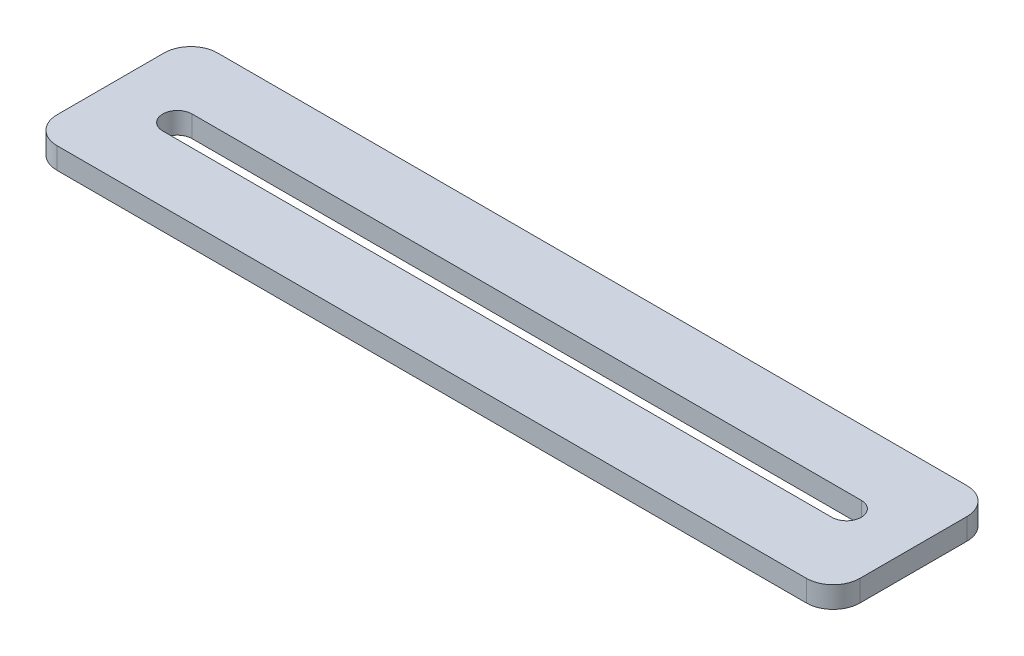
ISO-10303-21;
HEADER;
FILE_DESCRIPTION(('STEP AP214'),'2;1');
FILE_NAME('part.step','',(''),(''),'','','');
FILE_SCHEMA(('AUTOMOTIVE_DESIGN { 1 0 10303 214 1 1 1 1 }'));
ENDSEC;
DATA;
#1=APPLICATION_CONTEXT('core data for automotive mechanical design processes');
#2=APPLICATION_PROTOCOL_DEFINITION('international standard','automotive_design',2000,#1);
#3=PRODUCT_CONTEXT('',#1,'mechanical');
#4=PRODUCT('Part','Part','',(#3));
#5=PRODUCT_RELATED_PRODUCT_CATEGORY('part','',(#4));
#6=PRODUCT_DEFINITION_FORMATION('','',#4);
#7=PRODUCT_DEFINITION_CONTEXT('part definition',#1,'design');
#8=PRODUCT_DEFINITION('design','',#6,#7);
#9=PRODUCT_DEFINITION_SHAPE('','',#8);
#10=(LENGTH_UNIT() NAMED_UNIT(*) SI_UNIT(.MILLI.,.METRE.));
#11=(NAMED_UNIT(*) PLANE_ANGLE_UNIT() SI_UNIT($,.RADIAN.));
#12=(NAMED_UNIT(*) SI_UNIT($,.STERADIAN.) SOLID_ANGLE_UNIT());
#13=UNCERTAINTY_MEASURE_WITH_UNIT(LENGTH_MEASURE(1.E-05),#10,'distance_accuracy_value','');
#14=(GEOMETRIC_REPRESENTATION_CONTEXT(3) GLOBAL_UNCERTAINTY_ASSIGNED_CONTEXT((#13)) GLOBAL_UNIT_ASSIGNED_CONTEXT((#10,
#11,#12)) REPRESENTATION_CONTEXT('',''));
#15=CARTESIAN_POINT('',(0.,0.,0.));
#16=DIRECTION('',(0.,0.,1.));
#17=DIRECTION('',(1.,0.,0.));
#18=AXIS2_PLACEMENT_3D('',#15,#16,#17);
#19=CARTESIAN_POINT('',(0.,4.,0.));
#20=DIRECTION('',(0.,-1.,0.));
#21=DIRECTION('',(0.,0.,-1.));
#22=AXIS2_PLACEMENT_3D('',#19,#20,#21);
#23=PLANE('',#22);
#24=DIRECTION('',(1.,0.,0.));
#25=VECTOR('',#24,1.);
#26=CARTESIAN_POINT('',(-75.,4.,15.));
#27=LINE('',#26,#25);
#28=CARTESIAN_POINT('',(-70.,4.,15.));
#29=VERTEX_POINT('',#28);
#30=CARTESIAN_POINT('',(70.,4.,15.));
#31=VERTEX_POINT('',#30);
#32=EDGE_CURVE('E173',#29,#31,#27,.T.);
#33=ORIENTED_EDGE('',*,*,#32,.T.);
#34=CARTESIAN_POINT('',(70.,4.,10.));
#35=DIRECTION('',(0.,-1.,0.));
#36=DIRECTION('',(0.,0.,-1.));
#37=AXIS2_PLACEMENT_3D('',#34,#35,#36);
#38=CIRCLE('',#37,5.);
#39=CARTESIAN_POINT('',(75.,4.,10.));
#40=VERTEX_POINT('',#39);
#41=EDGE_CURVE('E208',#31,#40,#38,.F.);
#42=ORIENTED_EDGE('',*,*,#41,.T.);
#43=DIRECTION('',(0.,0.,-1.));
#44=VECTOR('',#43,1.);
#45=CARTESIAN_POINT('',(75.,4.,15.));
#46=LINE('',#45,#44);
#47=CARTESIAN_POINT('',(75.,4.,-10.));
#48=VERTEX_POINT('',#47);
#49=EDGE_CURVE('E165',#40,#48,#46,.T.);
#50=ORIENTED_EDGE('',*,*,#49,.T.);
#51=CARTESIAN_POINT('',(70.,4.,-10.));
#52=DIRECTION('',(0.,-1.,0.));
#53=DIRECTION('',(0.,0.,-1.));
#54=AXIS2_PLACEMENT_3D('',#51,#52,#53);
#55=CIRCLE('',#54,5.);
#56=CARTESIAN_POINT('',(70.,4.,-15.));
#57=VERTEX_POINT('',#56);
#58=EDGE_CURVE('E206',#48,#57,#55,.F.);
#59=ORIENTED_EDGE('',*,*,#58,.T.);
#60=DIRECTION('',(-1.,0.,0.));
#61=VECTOR('',#60,1.);
#62=CARTESIAN_POINT('',(-75.,4.,-15.));
#63=LINE('',#62,#61);
#64=CARTESIAN_POINT('',(-70.,4.,-15.));
#65=VERTEX_POINT('',#64);
#66=EDGE_CURVE('E168',#57,#65,#63,.T.);
#67=ORIENTED_EDGE('',*,*,#66,.T.);
#68=CARTESIAN_POINT('',(-70.,4.,-10.));
#69=DIRECTION('',(0.,-1.,0.));
#70=DIRECTION('',(0.,0.,-1.));
#71=AXIS2_PLACEMENT_3D('',#68,#69,#70);
#72=CIRCLE('',#71,5.);
#73=CARTESIAN_POINT('',(-75.,4.,-10.));
#74=VERTEX_POINT('',#73);
#75=EDGE_CURVE('E54',#65,#74,#72,.F.);
#76=ORIENTED_EDGE('',*,*,#75,.T.);
#77=DIRECTION('',(0.,0.,1.));
#78=VECTOR('',#77,1.);
#79=CARTESIAN_POINT('',(-75.,4.,15.));
#80=LINE('',#79,#78);
#81=CARTESIAN_POINT('',(-75.,4.,10.));
#82=VERTEX_POINT('',#81);
#83=EDGE_CURVE('E171',#74,#82,#80,.T.);
#84=ORIENTED_EDGE('',*,*,#83,.T.);
#85=CARTESIAN_POINT('',(-70.,4.,10.));
#86=DIRECTION('',(0.,-1.,0.));
#87=DIRECTION('',(0.,0.,-1.));
#88=AXIS2_PLACEMENT_3D('',#85,#86,#87);
#89=CIRCLE('',#88,5.);
#90=EDGE_CURVE('E203',#82,#29,#89,.F.);
#91=ORIENTED_EDGE('',*,*,#90,.T.);
#92=EDGE_LOOP('',(#33,#42,#50,#59,#67,#76,#84,#91));
#93=FACE_BOUND('',#92,.T.);
#94=CARTESIAN_POINT('',(-62.5,4.,0.));
#95=DIRECTION('',(0.,1.,0.));
#96=DIRECTION('',(0.,0.,1.));
#97=AXIS2_PLACEMENT_3D('',#94,#95,#96);
#98=CIRCLE('',#97,2.75);
#99=CARTESIAN_POINT('',(-62.5,4.,-2.75));
#100=VERTEX_POINT('',#99);
#101=CARTESIAN_POINT('',(-62.5,4.,2.75));
#102=VERTEX_POINT('',#101);
#103=EDGE_CURVE('E124',#100,#102,#98,.T.);
#104=ORIENTED_EDGE('',*,*,#103,.F.);
#105=DIRECTION('',(-1.,0.,0.));
#106=VECTOR('',#105,1.);
#107=CARTESIAN_POINT('',(-62.5,4.,-2.75));
#108=LINE('',#107,#106);
#109=CARTESIAN_POINT('',(62.5,4.,-2.75000000000002));
#110=VERTEX_POINT('',#109);
#111=EDGE_CURVE('E149',#110,#100,#108,.T.);
#112=ORIENTED_EDGE('',*,*,#111,.F.);
#113=CARTESIAN_POINT('',(62.5,4.,0.));
#114=DIRECTION('',(0.,1.,0.));
#115=DIRECTION('',(0.,0.,1.));
#116=AXIS2_PLACEMENT_3D('',#113,#114,#115);
#117=CIRCLE('',#116,2.75);
#118=CARTESIAN_POINT('',(62.5,4.,2.74999999999998));
#119=VERTEX_POINT('',#118);
#120=EDGE_CURVE('E147',#119,#110,#117,.T.);
#121=ORIENTED_EDGE('',*,*,#120,.F.);
#122=DIRECTION('',(1.,0.,0.));
#123=VECTOR('',#122,1.);
#124=CARTESIAN_POINT('',(-62.5,4.,2.75));
#125=LINE('',#124,#123);
#126=EDGE_CURVE('E134',#102,#119,#125,.T.);
#127=ORIENTED_EDGE('',*,*,#126,.F.);
#128=EDGE_LOOP('',(#104,#112,#121,#127));
#129=FACE_BOUND('',#128,.T.);
#130=ADVANCED_FACE('F33',(#93,#129),#23,.F.);
#131=CARTESIAN_POINT('',(0.,0.,0.));
#132=DIRECTION('',(0.,-1.,0.));
#133=DIRECTION('',(0.,0.,-1.));
#134=AXIS2_PLACEMENT_3D('',#131,#132,#133);
#135=PLANE('',#134);
#136=DIRECTION('',(0.,0.,-1.));
#137=VECTOR('',#136,1.);
#138=CARTESIAN_POINT('',(75.,0.,15.));
#139=LINE('',#138,#137);
#140=CARTESIAN_POINT('',(75.,0.,10.));
#141=VERTEX_POINT('',#140);
#142=CARTESIAN_POINT('',(75.,0.,-10.));
#143=VERTEX_POINT('',#142);
#144=EDGE_CURVE('E142',#141,#143,#139,.T.);
#145=ORIENTED_EDGE('',*,*,#144,.F.);
#146=CARTESIAN_POINT('',(70.,0.,10.));
#147=DIRECTION('',(0.,-1.,0.));
#148=DIRECTION('',(0.,0.,-1.));
#149=AXIS2_PLACEMENT_3D('',#146,#147,#148);
#150=CIRCLE('',#149,5.);
#151=CARTESIAN_POINT('',(70.,0.,15.));
#152=VERTEX_POINT('',#151);
#153=EDGE_CURVE('E196',#141,#152,#150,.T.);
#154=ORIENTED_EDGE('',*,*,#153,.T.);
#155=DIRECTION('',(1.,0.,0.));
#156=VECTOR('',#155,1.);
#157=CARTESIAN_POINT('',(-75.,0.,15.));
#158=LINE('',#157,#156);
#159=CARTESIAN_POINT('',(-70.,0.,15.));
#160=VERTEX_POINT('',#159);
#161=EDGE_CURVE('E169',#160,#152,#158,.T.);
#162=ORIENTED_EDGE('',*,*,#161,.F.);
#163=CARTESIAN_POINT('',(-70.,0.,10.));
#164=DIRECTION('',(0.,-1.,0.));
#165=DIRECTION('',(0.,0.,-1.));
#166=AXIS2_PLACEMENT_3D('',#163,#164,#165);
#167=CIRCLE('',#166,5.);
#168=CARTESIAN_POINT('',(-75.,0.,10.));
#169=VERTEX_POINT('',#168);
#170=EDGE_CURVE('E190',#160,#169,#167,.T.);
#171=ORIENTED_EDGE('',*,*,#170,.T.);
#172=DIRECTION('',(0.,0.,1.));
#173=VECTOR('',#172,1.);
#174=CARTESIAN_POINT('',(-75.,0.,15.));
#175=LINE('',#174,#173);
#176=CARTESIAN_POINT('',(-75.,0.,-10.));
#177=VERTEX_POINT('',#176);
#178=EDGE_CURVE('E182',#177,#169,#175,.T.);
#179=ORIENTED_EDGE('',*,*,#178,.F.);
#180=CARTESIAN_POINT('',(-70.,0.,-10.));
#181=DIRECTION('',(0.,-1.,0.));
#182=DIRECTION('',(0.,0.,-1.));
#183=AXIS2_PLACEMENT_3D('',#180,#181,#182);
#184=CIRCLE('',#183,5.);
#185=CARTESIAN_POINT('',(-70.,0.,-15.));
#186=VERTEX_POINT('',#185);
#187=EDGE_CURVE('E192',#177,#186,#184,.T.);
#188=ORIENTED_EDGE('',*,*,#187,.T.);
#189=DIRECTION('',(-1.,0.,0.));
#190=VECTOR('',#189,1.);
#191=CARTESIAN_POINT('',(-75.,0.,-15.));
#192=LINE('',#191,#190);
#193=CARTESIAN_POINT('',(70.,0.,-15.));
#194=VERTEX_POINT('',#193);
#195=EDGE_CURVE('E179',#194,#186,#192,.T.);
#196=ORIENTED_EDGE('',*,*,#195,.F.);
#197=CARTESIAN_POINT('',(70.,0.,-10.));
#198=DIRECTION('',(0.,-1.,0.));
#199=DIRECTION('',(0.,0.,-1.));
#200=AXIS2_PLACEMENT_3D('',#197,#198,#199);
#201=CIRCLE('',#200,5.);
#202=EDGE_CURVE('E194',#194,#143,#201,.T.);
#203=ORIENTED_EDGE('',*,*,#202,.T.);
#204=EDGE_LOOP('',(#145,#154,#162,#171,#179,#188,#196,#203));
#205=FACE_BOUND('',#204,.T.);
#206=DIRECTION('',(-1.,0.,0.));
#207=VECTOR('',#206,1.);
#208=CARTESIAN_POINT('',(-62.5,0.,-2.75));
#209=LINE('',#208,#207);
#210=CARTESIAN_POINT('',(62.5,0.,-2.75000000000002));
#211=VERTEX_POINT('',#210);
#212=CARTESIAN_POINT('',(-62.5,0.,-2.75));
#213=VERTEX_POINT('',#212);
#214=EDGE_CURVE('E135',#211,#213,#209,.T.);
#215=ORIENTED_EDGE('',*,*,#214,.T.);
#216=CARTESIAN_POINT('',(-62.5,0.,0.));
#217=DIRECTION('',(0.,1.,0.));
#218=DIRECTION('',(0.,0.,1.));
#219=AXIS2_PLACEMENT_3D('',#216,#217,#218);
#220=CIRCLE('',#219,2.75);
#221=CARTESIAN_POINT('',(-62.5,0.,2.75));
#222=VERTEX_POINT('',#221);
#223=EDGE_CURVE('E153',#213,#222,#220,.T.);
#224=ORIENTED_EDGE('',*,*,#223,.T.);
#225=DIRECTION('',(1.,0.,0.));
#226=VECTOR('',#225,1.);
#227=CARTESIAN_POINT('',(-62.5,0.,2.75));
#228=LINE('',#227,#226);
#229=CARTESIAN_POINT('',(62.5,0.,2.74999999999998));
#230=VERTEX_POINT('',#229);
#231=EDGE_CURVE('E141',#222,#230,#228,.T.);
#232=ORIENTED_EDGE('',*,*,#231,.T.);
#233=CARTESIAN_POINT('',(62.5,0.,0.));
#234=DIRECTION('',(0.,1.,0.));
#235=DIRECTION('',(0.,0.,1.));
#236=AXIS2_PLACEMENT_3D('',#233,#234,#235);
#237=CIRCLE('',#236,2.75);
#238=EDGE_CURVE('E156',#230,#211,#237,.T.);
#239=ORIENTED_EDGE('',*,*,#238,.T.);
#240=EDGE_LOOP('',(#215,#224,#232,#239));
#241=FACE_BOUND('',#240,.T.);
#242=ADVANCED_FACE('F224',(#205,#241),#135,.T.);
#243=CARTESIAN_POINT('',(75.,4.,15.));
#244=DIRECTION('',(-1.,0.,0.));
#245=DIRECTION('',(0.,0.,1.));
#246=AXIS2_PLACEMENT_3D('',#243,#244,#245);
#247=PLANE('',#246);
#248=ORIENTED_EDGE('',*,*,#49,.F.);
#249=DIRECTION('',(0.,-1.,0.));
#250=VECTOR('',#249,1.);
#251=CARTESIAN_POINT('',(75.,4.,10.));
#252=LINE('',#251,#250);
#253=EDGE_CURVE('E187',#40,#141,#252,.T.);
#254=ORIENTED_EDGE('',*,*,#253,.T.);
#255=ORIENTED_EDGE('',*,*,#144,.T.);
#256=DIRECTION('',(0.,-1.,0.));
#257=VECTOR('',#256,1.);
#258=CARTESIAN_POINT('',(75.,4.,-10.));
#259=LINE('',#258,#257);
#260=EDGE_CURVE('E176',#143,#48,#259,.F.);
#261=ORIENTED_EDGE('',*,*,#260,.T.);
#262=EDGE_LOOP('',(#248,#254,#255,#261));
#263=FACE_BOUND('',#262,.T.);
#264=ADVANCED_FACE('F245',(#263),#247,.F.);
#265=CARTESIAN_POINT('',(-75.,4.,-15.));
#266=DIRECTION('',(0.,0.,1.));
#267=DIRECTION('',(1.,0.,0.));
#268=AXIS2_PLACEMENT_3D('',#265,#266,#267);
#269=PLANE('',#268);
#270=ORIENTED_EDGE('',*,*,#66,.F.);
#271=DIRECTION('',(0.,-1.,0.));
#272=VECTOR('',#271,1.);
#273=CARTESIAN_POINT('',(70.,4.,-15.));
#274=LINE('',#273,#272);
#275=EDGE_CURVE('E212',#57,#194,#274,.T.);
#276=ORIENTED_EDGE('',*,*,#275,.T.);
#277=ORIENTED_EDGE('',*,*,#195,.T.);
#278=DIRECTION('',(0.,-1.,0.));
#279=VECTOR('',#278,1.);
#280=CARTESIAN_POINT('',(-70.,4.,-15.));
#281=LINE('',#280,#279);
#282=EDGE_CURVE('E210',#186,#65,#281,.F.);
#283=ORIENTED_EDGE('',*,*,#282,.T.);
#284=EDGE_LOOP('',(#270,#276,#277,#283));
#285=FACE_BOUND('',#284,.T.);
#286=ADVANCED_FACE('F218',(#285),#269,.F.);
#287=CARTESIAN_POINT('',(-75.,4.,15.));
#288=DIRECTION('',(1.,0.,0.));
#289=DIRECTION('',(0.,0.,-1.));
#290=AXIS2_PLACEMENT_3D('',#287,#288,#289);
#291=PLANE('',#290);
#292=ORIENTED_EDGE('',*,*,#83,.F.);
#293=DIRECTION('',(0.,-1.,0.));
#294=VECTOR('',#293,1.);
#295=CARTESIAN_POINT('',(-75.,4.,-10.));
#296=LINE('',#295,#294);
#297=EDGE_CURVE('E11',#74,#177,#296,.T.);
#298=ORIENTED_EDGE('',*,*,#297,.T.);
#299=ORIENTED_EDGE('',*,*,#178,.T.);
#300=DIRECTION('',(0.,-1.,0.));
#301=VECTOR('',#300,1.);
#302=CARTESIAN_POINT('',(-75.,4.,10.));
#303=LINE('',#302,#301);
#304=EDGE_CURVE('E41',#169,#82,#303,.F.);
#305=ORIENTED_EDGE('',*,*,#304,.T.);
#306=EDGE_LOOP('',(#292,#298,#299,#305));
#307=FACE_BOUND('',#306,.T.);
#308=ADVANCED_FACE('F230',(#307),#291,.F.);
#309=CARTESIAN_POINT('',(-75.,4.,15.));
#310=DIRECTION('',(0.,0.,-1.));
#311=DIRECTION('',(-1.,0.,0.));
#312=AXIS2_PLACEMENT_3D('',#309,#310,#311);
#313=PLANE('',#312);
#314=ORIENTED_EDGE('',*,*,#161,.T.);
#315=DIRECTION('',(0.,-1.,0.));
#316=VECTOR('',#315,1.);
#317=CARTESIAN_POINT('',(70.,4.,15.));
#318=LINE('',#317,#316);
#319=EDGE_CURVE('E201',#152,#31,#318,.F.);
#320=ORIENTED_EDGE('',*,*,#319,.T.);
#321=ORIENTED_EDGE('',*,*,#32,.F.);
#322=DIRECTION('',(0.,-1.,0.));
#323=VECTOR('',#322,1.);
#324=CARTESIAN_POINT('',(-70.,4.,15.));
#325=LINE('',#324,#323);
#326=EDGE_CURVE('E198',#29,#160,#325,.T.);
#327=ORIENTED_EDGE('',*,*,#326,.T.);
#328=EDGE_LOOP('',(#314,#320,#321,#327));
#329=FACE_BOUND('',#328,.T.);
#330=ADVANCED_FACE('F237',(#329),#313,.F.);
#331=CARTESIAN_POINT('',(-62.5,4.,0.));
#332=DIRECTION('',(0.,-1.,0.));
#333=DIRECTION('',(0.,0.,-1.));
#334=AXIS2_PLACEMENT_3D('',#331,#332,#333);
#335=CYLINDRICAL_SURFACE('',#334,2.75);
#336=ORIENTED_EDGE('',*,*,#223,.F.);
#337=DIRECTION('',(0.,-1.,0.));
#338=VECTOR('',#337,1.);
#339=CARTESIAN_POINT('',(-62.5,4.,-2.75));
#340=LINE('',#339,#338);
#341=EDGE_CURVE('E130',#100,#213,#340,.T.);
#342=ORIENTED_EDGE('',*,*,#341,.F.);
#343=ORIENTED_EDGE('',*,*,#103,.T.);
#344=DIRECTION('',(0.,-1.,0.));
#345=VECTOR('',#344,1.);
#346=CARTESIAN_POINT('',(-62.5,4.,2.75));
#347=LINE('',#346,#345);
#348=EDGE_CURVE('E127',#102,#222,#347,.T.);
#349=ORIENTED_EDGE('',*,*,#348,.T.);
#350=EDGE_LOOP('',(#336,#342,#343,#349));
#351=FACE_BOUND('',#350,.T.);
#352=ADVANCED_FACE('F126',(#351),#335,.F.);
#353=CARTESIAN_POINT('',(-62.5,4.,2.75));
#354=DIRECTION('',(0.,0.,-1.));
#355=DIRECTION('',(-1.,0.,0.));
#356=AXIS2_PLACEMENT_3D('',#353,#354,#355);
#357=PLANE('',#356);
#358=ORIENTED_EDGE('',*,*,#231,.F.);
#359=ORIENTED_EDGE('',*,*,#348,.F.);
#360=ORIENTED_EDGE('',*,*,#126,.T.);
#361=DIRECTION('',(0.,-1.,0.));
#362=VECTOR('',#361,1.);
#363=CARTESIAN_POINT('',(62.5,4.,2.74999999999998));
#364=LINE('',#363,#362);
#365=EDGE_CURVE('E143',#119,#230,#364,.T.);
#366=ORIENTED_EDGE('',*,*,#365,.T.);
#367=EDGE_LOOP('',(#358,#359,#360,#366));
#368=FACE_BOUND('',#367,.T.);
#369=ADVANCED_FACE('F138',(#368),#357,.T.);
#370=CARTESIAN_POINT('',(62.5,4.,0.));
#371=DIRECTION('',(0.,-1.,0.));
#372=DIRECTION('',(0.,0.,-1.));
#373=AXIS2_PLACEMENT_3D('',#370,#371,#372);
#374=CYLINDRICAL_SURFACE('',#373,2.75);
#375=ORIENTED_EDGE('',*,*,#238,.F.);
#376=ORIENTED_EDGE('',*,*,#365,.F.);
#377=ORIENTED_EDGE('',*,*,#120,.T.);
#378=DIRECTION('',(0.,-1.,0.));
#379=VECTOR('',#378,1.);
#380=CARTESIAN_POINT('',(62.5,4.,-2.75000000000002));
#381=LINE('',#380,#379);
#382=EDGE_CURVE('E162',#110,#211,#381,.T.);
#383=ORIENTED_EDGE('',*,*,#382,.T.);
#384=EDGE_LOOP('',(#375,#376,#377,#383));
#385=FACE_BOUND('',#384,.T.);
#386=ADVANCED_FACE('F300',(#385),#374,.F.);
#387=CARTESIAN_POINT('',(-62.5,4.,-2.75));
#388=DIRECTION('',(0.,0.,1.));
#389=DIRECTION('',(1.,0.,0.));
#390=AXIS2_PLACEMENT_3D('',#387,#388,#389);
#391=PLANE('',#390);
#392=ORIENTED_EDGE('',*,*,#214,.F.);
#393=ORIENTED_EDGE('',*,*,#382,.F.);
#394=ORIENTED_EDGE('',*,*,#111,.T.);
#395=ORIENTED_EDGE('',*,*,#341,.T.);
#396=EDGE_LOOP('',(#392,#393,#394,#395));
#397=FACE_BOUND('',#396,.T.);
#398=ADVANCED_FACE('F254',(#397),#391,.T.);
#399=CARTESIAN_POINT('',(70.,4.,10.));
#400=DIRECTION('',(0.,-1.,0.));
#401=DIRECTION('',(0.,0.,-1.));
#402=AXIS2_PLACEMENT_3D('',#399,#400,#401);
#403=CYLINDRICAL_SURFACE('',#402,5.);
#404=ORIENTED_EDGE('',*,*,#41,.F.);
#405=ORIENTED_EDGE('',*,*,#319,.F.);
#406=ORIENTED_EDGE('',*,*,#153,.F.);
#407=ORIENTED_EDGE('',*,*,#253,.F.);
#408=EDGE_LOOP('',(#404,#405,#406,#407));
#409=FACE_BOUND('',#408,.T.);
#410=ADVANCED_FACE('F242',(#409),#403,.T.);
#411=CARTESIAN_POINT('',(70.,4.,-10.));
#412=DIRECTION('',(0.,-1.,0.));
#413=DIRECTION('',(0.,0.,-1.));
#414=AXIS2_PLACEMENT_3D('',#411,#412,#413);
#415=CYLINDRICAL_SURFACE('',#414,5.);
#416=ORIENTED_EDGE('',*,*,#58,.F.);
#417=ORIENTED_EDGE('',*,*,#260,.F.);
#418=ORIENTED_EDGE('',*,*,#202,.F.);
#419=ORIENTED_EDGE('',*,*,#275,.F.);
#420=EDGE_LOOP('',(#416,#417,#418,#419));
#421=FACE_BOUND('',#420,.T.);
#422=ADVANCED_FACE('F247',(#421),#415,.T.);
#423=CARTESIAN_POINT('',(-70.,4.,-10.));
#424=DIRECTION('',(0.,-1.,0.));
#425=DIRECTION('',(0.,0.,-1.));
#426=AXIS2_PLACEMENT_3D('',#423,#424,#425);
#427=CYLINDRICAL_SURFACE('',#426,5.);
#428=ORIENTED_EDGE('',*,*,#75,.F.);
#429=ORIENTED_EDGE('',*,*,#282,.F.);
#430=ORIENTED_EDGE('',*,*,#187,.F.);
#431=ORIENTED_EDGE('',*,*,#297,.F.);
#432=EDGE_LOOP('',(#428,#429,#430,#431));
#433=FACE_BOUND('',#432,.T.);
#434=ADVANCED_FACE('F229',(#433),#427,.T.);
#435=CARTESIAN_POINT('',(-70.,4.,10.));
#436=DIRECTION('',(0.,-1.,0.));
#437=DIRECTION('',(0.,0.,-1.));
#438=AXIS2_PLACEMENT_3D('',#435,#436,#437);
#439=CYLINDRICAL_SURFACE('',#438,5.);
#440=ORIENTED_EDGE('',*,*,#90,.F.);
#441=ORIENTED_EDGE('',*,*,#304,.F.);
#442=ORIENTED_EDGE('',*,*,#170,.F.);
#443=ORIENTED_EDGE('',*,*,#326,.F.);
#444=EDGE_LOOP('',(#440,#441,#442,#443));
#445=FACE_BOUND('',#444,.T.);
#446=ADVANCED_FACE('F35',(#445),#439,.T.);
#447=CLOSED_SHELL('',(#130,#242,#264,#286,#308,#330,#352,#369,#386,#398,#410,#422,#434,#446));
#448=MANIFOLD_SOLID_BREP('B2',#447);
#449=ADVANCED_BREP_SHAPE_REPRESENTATION('',(#18,#448),#14);
#450=SHAPE_DEFINITION_REPRESENTATION(#9,#449);
ENDSEC;
END-ISO-10303-21;
